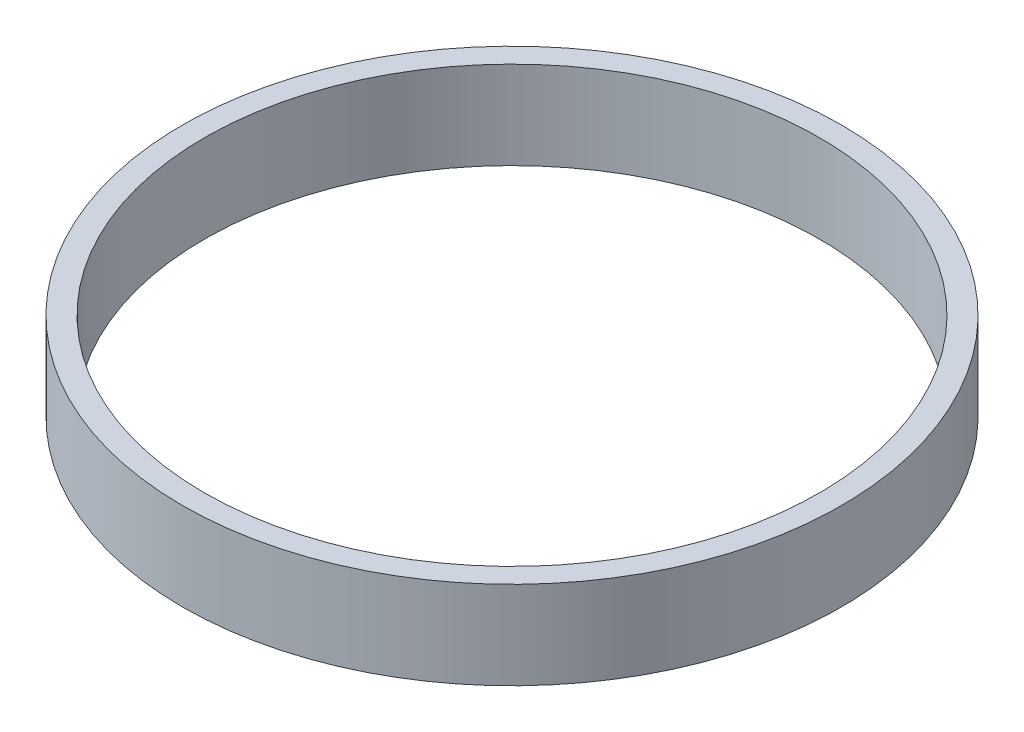
ISO-10303-21;
HEADER;
FILE_DESCRIPTION(('STEP AP214'),'2;1');
FILE_NAME('part.step','',(''),(''),'','','');
FILE_SCHEMA(('AUTOMOTIVE_DESIGN { 1 0 10303 214 1 1 1 1 }'));
ENDSEC;
DATA;
#1=APPLICATION_CONTEXT('core data for automotive mechanical design processes');
#2=APPLICATION_PROTOCOL_DEFINITION('international standard','automotive_design',2000,#1);
#3=PRODUCT_CONTEXT('',#1,'mechanical');
#4=PRODUCT('Part','Part','',(#3));
#5=PRODUCT_RELATED_PRODUCT_CATEGORY('part','',(#4));
#6=PRODUCT_DEFINITION_FORMATION('','',#4);
#7=PRODUCT_DEFINITION_CONTEXT('part definition',#1,'design');
#8=PRODUCT_DEFINITION('design','',#6,#7);
#9=PRODUCT_DEFINITION_SHAPE('','',#8);
#10=(LENGTH_UNIT() NAMED_UNIT(*) SI_UNIT(.MILLI.,.METRE.));
#11=(NAMED_UNIT(*) PLANE_ANGLE_UNIT() SI_UNIT($,.RADIAN.));
#12=(NAMED_UNIT(*) SI_UNIT($,.STERADIAN.) SOLID_ANGLE_UNIT());
#13=UNCERTAINTY_MEASURE_WITH_UNIT(LENGTH_MEASURE(1.E-05),#10,'distance_accuracy_value','');
#14=(GEOMETRIC_REPRESENTATION_CONTEXT(3) GLOBAL_UNCERTAINTY_ASSIGNED_CONTEXT((#13)) GLOBAL_UNIT_ASSIGNED_CONTEXT((#10,
#11,#12)) REPRESENTATION_CONTEXT('',''));
#15=CARTESIAN_POINT('',(0.,0.,0.));
#16=DIRECTION('',(0.,0.,1.));
#17=DIRECTION('',(1.,0.,0.));
#18=AXIS2_PLACEMENT_3D('',#15,#16,#17);
#19=CARTESIAN_POINT('',(0.,10.,0.));
#20=DIRECTION('',(0.,1.,0.));
#21=DIRECTION('',(0.,0.,1.));
#22=AXIS2_PLACEMENT_3D('',#19,#20,#21);
#23=PLANE('',#22);
#24=CARTESIAN_POINT('',(0.,10.,0.));
#25=DIRECTION('',(0.,1.,0.));
#26=DIRECTION('',(0.,0.,1.));
#27=AXIS2_PLACEMENT_3D('',#24,#25,#26);
#28=CIRCLE('',#27,37.5);
#29=CARTESIAN_POINT('',(0.,10.,37.5));
#30=VERTEX_POINT('',#29);
#31=EDGE_CURVE('E10',#30,#30,#28,.T.);
#32=ORIENTED_EDGE('',*,*,#31,.T.);
#33=EDGE_LOOP('',(#32));
#34=FACE_BOUND('',#33,.T.);
#35=CARTESIAN_POINT('',(0.,10.,0.));
#36=DIRECTION('',(0.,1.,0.));
#37=DIRECTION('',(0.,0.,1.));
#38=AXIS2_PLACEMENT_3D('',#35,#36,#37);
#39=CIRCLE('',#38,35.);
#40=CARTESIAN_POINT('',(0.,10.,35.));
#41=VERTEX_POINT('',#40);
#42=EDGE_CURVE('E41',#41,#41,#39,.T.);
#43=ORIENTED_EDGE('',*,*,#42,.F.);
#44=EDGE_LOOP('',(#43));
#45=FACE_BOUND('',#44,.T.);
#46=ADVANCED_FACE('F30',(#34,#45),#23,.T.);
#47=CARTESIAN_POINT('',(0.,0.,0.));
#48=DIRECTION('',(0.,1.,0.));
#49=DIRECTION('',(0.,0.,1.));
#50=AXIS2_PLACEMENT_3D('',#47,#48,#49);
#51=PLANE('',#50);
#52=CARTESIAN_POINT('',(0.,0.,0.));
#53=DIRECTION('',(0.,1.,0.));
#54=DIRECTION('',(0.,0.,1.));
#55=AXIS2_PLACEMENT_3D('',#52,#53,#54);
#56=CIRCLE('',#55,37.5);
#57=CARTESIAN_POINT('',(0.,0.,37.5));
#58=VERTEX_POINT('',#57);
#59=EDGE_CURVE('E34',#58,#58,#56,.T.);
#60=ORIENTED_EDGE('',*,*,#59,.F.);
#61=EDGE_LOOP('',(#60));
#62=FACE_BOUND('',#61,.T.);
#63=CARTESIAN_POINT('',(0.,0.,0.));
#64=DIRECTION('',(0.,1.,0.));
#65=DIRECTION('',(0.,0.,1.));
#66=AXIS2_PLACEMENT_3D('',#63,#64,#65);
#67=CIRCLE('',#66,35.);
#68=CARTESIAN_POINT('',(0.,0.,35.));
#69=VERTEX_POINT('',#68);
#70=EDGE_CURVE('E43',#69,#69,#67,.T.);
#71=ORIENTED_EDGE('',*,*,#70,.T.);
#72=EDGE_LOOP('',(#71));
#73=FACE_BOUND('',#72,.T.);
#74=ADVANCED_FACE('F53',(#62,#73),#51,.F.);
#75=CARTESIAN_POINT('',(0.,10.,0.));
#76=DIRECTION('',(0.,-1.,0.));
#77=DIRECTION('',(0.,0.,-1.));
#78=AXIS2_PLACEMENT_3D('',#75,#76,#77);
#79=CYLINDRICAL_SURFACE('',#78,37.5);
#80=ORIENTED_EDGE('',*,*,#31,.F.);
#81=EDGE_LOOP('',(#80));
#82=FACE_BOUND('',#81,.T.);
#83=ORIENTED_EDGE('',*,*,#59,.T.);
#84=EDGE_LOOP('',(#83));
#85=FACE_BOUND('',#84,.T.);
#86=ADVANCED_FACE('F32',(#82,#85),#79,.T.);
#87=CARTESIAN_POINT('',(0.,10.,0.));
#88=DIRECTION('',(0.,-1.,0.));
#89=DIRECTION('',(0.,0.,-1.));
#90=AXIS2_PLACEMENT_3D('',#87,#88,#89);
#91=CYLINDRICAL_SURFACE('',#90,35.);
#92=ORIENTED_EDGE('',*,*,#42,.T.);
#93=EDGE_LOOP('',(#92));
#94=FACE_BOUND('',#93,.T.);
#95=ORIENTED_EDGE('',*,*,#70,.F.);
#96=EDGE_LOOP('',(#95));
#97=FACE_BOUND('',#96,.T.);
#98=ADVANCED_FACE('F49',(#94,#97),#91,.F.);
#99=CLOSED_SHELL('',(#46,#74,#86,#98));
#100=MANIFOLD_SOLID_BREP('B2',#99);
#101=ADVANCED_BREP_SHAPE_REPRESENTATION('',(#18,#100),#14);
#102=SHAPE_DEFINITION_REPRESENTATION(#9,#101);
ENDSEC;
END-ISO-10303-21;
